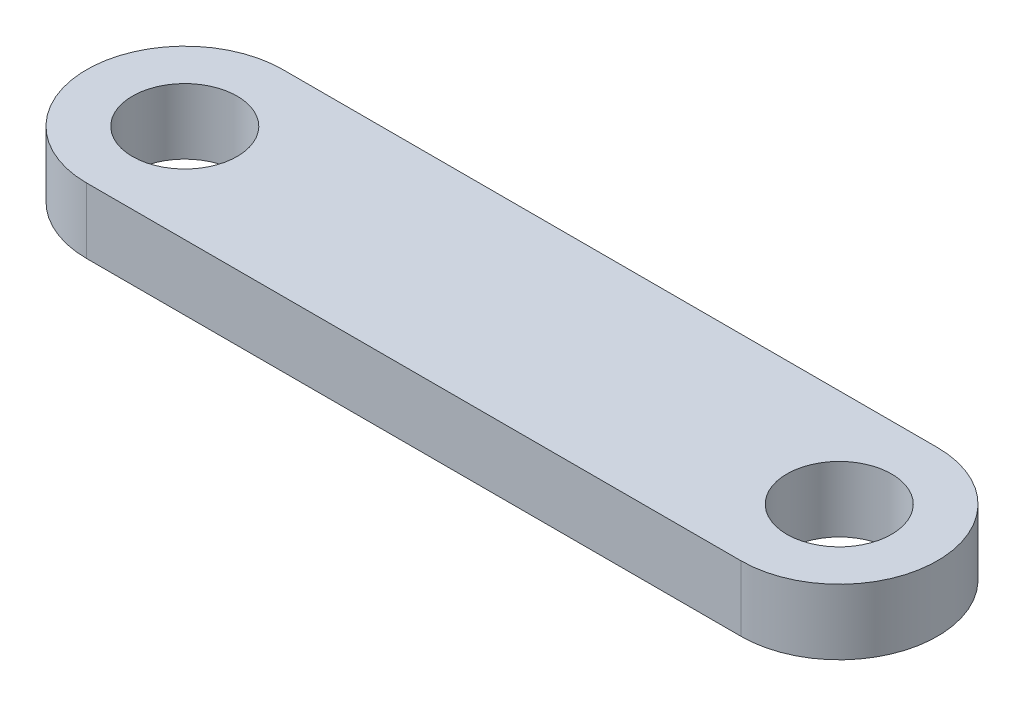
ISO-10303-21;
HEADER;
FILE_DESCRIPTION(('STEP AP214'),'2;1');
FILE_NAME('part.step','',(''),(''),'','','');
FILE_SCHEMA(('AUTOMOTIVE_DESIGN { 1 0 10303 214 1 1 1 1 }'));
ENDSEC;
DATA;
#1=APPLICATION_CONTEXT('core data for automotive mechanical design processes');
#2=APPLICATION_PROTOCOL_DEFINITION('international standard','automotive_design',2000,#1);
#3=PRODUCT_CONTEXT('',#1,'mechanical');
#4=PRODUCT('Part','Part','',(#3));
#5=PRODUCT_RELATED_PRODUCT_CATEGORY('part','',(#4));
#6=PRODUCT_DEFINITION_FORMATION('','',#4);
#7=PRODUCT_DEFINITION_CONTEXT('part definition',#1,'design');
#8=PRODUCT_DEFINITION('design','',#6,#7);
#9=PRODUCT_DEFINITION_SHAPE('','',#8);
#10=(LENGTH_UNIT() NAMED_UNIT(*) SI_UNIT(.MILLI.,.METRE.));
#11=(NAMED_UNIT(*) PLANE_ANGLE_UNIT() SI_UNIT($,.RADIAN.));
#12=(NAMED_UNIT(*) SI_UNIT($,.STERADIAN.) SOLID_ANGLE_UNIT());
#13=UNCERTAINTY_MEASURE_WITH_UNIT(LENGTH_MEASURE(1.E-05),#10,'distance_accuracy_value','');
#14=(GEOMETRIC_REPRESENTATION_CONTEXT(3) GLOBAL_UNCERTAINTY_ASSIGNED_CONTEXT((#13)) GLOBAL_UNIT_ASSIGNED_CONTEXT((#10,
#11,#12)) REPRESENTATION_CONTEXT('',''));
#15=CARTESIAN_POINT('',(0.,0.,0.));
#16=DIRECTION('',(0.,0.,1.));
#17=DIRECTION('',(1.,0.,0.));
#18=AXIS2_PLACEMENT_3D('',#15,#16,#17);
#19=CARTESIAN_POINT('',(0.,5.,0.));
#20=DIRECTION('',(0.,1.,0.));
#21=DIRECTION('',(0.,0.,1.));
#22=AXIS2_PLACEMENT_3D('',#19,#20,#21);
#23=PLANE('',#22);
#24=CARTESIAN_POINT('',(0.,5.,0.));
#25=DIRECTION('',(0.,1.,0.));
#26=DIRECTION('',(0.,0.,1.));
#27=AXIS2_PLACEMENT_3D('',#24,#25,#26);
#28=CIRCLE('',#27,4.);
#29=CARTESIAN_POINT('',(0.,5.,4.));
#30=VERTEX_POINT('',#29);
#31=EDGE_CURVE('E99',#30,#30,#28,.T.);
#32=ORIENTED_EDGE('',*,*,#31,.F.);
#33=EDGE_LOOP('',(#32));
#34=FACE_BOUND('',#33,.T.);
#35=CARTESIAN_POINT('',(0.,5.,0.));
#36=DIRECTION('',(0.,1.,0.));
#37=DIRECTION('',(0.,0.,1.));
#38=AXIS2_PLACEMENT_3D('',#35,#36,#37);
#39=CIRCLE('',#38,7.5);
#40=CARTESIAN_POINT('',(0.,5.,-7.5));
#41=VERTEX_POINT('',#40);
#42=CARTESIAN_POINT('',(0.,5.,7.5));
#43=VERTEX_POINT('',#42);
#44=EDGE_CURVE('E84',#41,#43,#39,.T.);
#45=ORIENTED_EDGE('',*,*,#44,.T.);
#46=DIRECTION('',(1.,0.,0.));
#47=VECTOR('',#46,1.);
#48=CARTESIAN_POINT('',(50.,5.,7.5));
#49=LINE('',#48,#47);
#50=CARTESIAN_POINT('',(50.,5.,7.5));
#51=VERTEX_POINT('',#50);
#52=EDGE_CURVE('E79',#43,#51,#49,.T.);
#53=ORIENTED_EDGE('',*,*,#52,.T.);
#54=CARTESIAN_POINT('',(50.,5.,0.));
#55=DIRECTION('',(0.,1.,0.));
#56=DIRECTION('',(0.,0.,1.));
#57=AXIS2_PLACEMENT_3D('',#54,#55,#56);
#58=CIRCLE('',#57,7.5);
#59=CARTESIAN_POINT('',(50.,5.,-7.5));
#60=VERTEX_POINT('',#59);
#61=EDGE_CURVE('E82',#51,#60,#58,.T.);
#62=ORIENTED_EDGE('',*,*,#61,.T.);
#63=DIRECTION('',(-1.,0.,0.));
#64=VECTOR('',#63,1.);
#65=CARTESIAN_POINT('',(0.,5.,-7.5));
#66=LINE('',#65,#64);
#67=EDGE_CURVE('E49',#60,#41,#66,.T.);
#68=ORIENTED_EDGE('',*,*,#67,.T.);
#69=EDGE_LOOP('',(#45,#53,#62,#68));
#70=FACE_BOUND('',#69,.T.);
#71=CARTESIAN_POINT('',(50.,5.,0.));
#72=DIRECTION('',(0.,1.,0.));
#73=DIRECTION('',(0.,0.,1.));
#74=AXIS2_PLACEMENT_3D('',#71,#72,#73);
#75=CIRCLE('',#74,4.00000000000001);
#76=CARTESIAN_POINT('',(50.,5.,4.00000000000001));
#77=VERTEX_POINT('',#76);
#78=EDGE_CURVE('E114',#77,#77,#75,.T.);
#79=ORIENTED_EDGE('',*,*,#78,.F.);
#80=EDGE_LOOP('',(#79));
#81=FACE_BOUND('',#80,.T.);
#82=ADVANCED_FACE('F32',(#34,#70,#81),#23,.T.);
#83=CARTESIAN_POINT('',(0.,0.,0.));
#84=DIRECTION('',(0.,1.,0.));
#85=DIRECTION('',(0.,0.,1.));
#86=AXIS2_PLACEMENT_3D('',#83,#84,#85);
#87=PLANE('',#86);
#88=CARTESIAN_POINT('',(0.,0.,0.));
#89=DIRECTION('',(0.,1.,0.));
#90=DIRECTION('',(0.,0.,1.));
#91=AXIS2_PLACEMENT_3D('',#88,#89,#90);
#92=CIRCLE('',#91,7.5);
#93=CARTESIAN_POINT('',(0.,0.,-7.5));
#94=VERTEX_POINT('',#93);
#95=CARTESIAN_POINT('',(0.,0.,7.5));
#96=VERTEX_POINT('',#95);
#97=EDGE_CURVE('E96',#94,#96,#92,.T.);
#98=ORIENTED_EDGE('',*,*,#97,.F.);
#99=DIRECTION('',(-1.,0.,0.));
#100=VECTOR('',#99,1.);
#101=CARTESIAN_POINT('',(0.,0.,-7.5));
#102=LINE('',#101,#100);
#103=CARTESIAN_POINT('',(50.,0.,-7.5));
#104=VERTEX_POINT('',#103);
#105=EDGE_CURVE('E72',#104,#94,#102,.T.);
#106=ORIENTED_EDGE('',*,*,#105,.F.);
#107=CARTESIAN_POINT('',(50.,0.,0.));
#108=DIRECTION('',(0.,1.,0.));
#109=DIRECTION('',(0.,0.,1.));
#110=AXIS2_PLACEMENT_3D('',#107,#108,#109);
#111=CIRCLE('',#110,7.5);
#112=CARTESIAN_POINT('',(50.,0.,7.5));
#113=VERTEX_POINT('',#112);
#114=EDGE_CURVE('E66',#113,#104,#111,.T.);
#115=ORIENTED_EDGE('',*,*,#114,.F.);
#116=DIRECTION('',(1.,0.,0.));
#117=VECTOR('',#116,1.);
#118=CARTESIAN_POINT('',(50.,0.,7.5));
#119=LINE('',#118,#117);
#120=EDGE_CURVE('E88',#96,#113,#119,.T.);
#121=ORIENTED_EDGE('',*,*,#120,.F.);
#122=EDGE_LOOP('',(#98,#106,#115,#121));
#123=FACE_BOUND('',#122,.T.);
#124=CARTESIAN_POINT('',(0.,0.,0.));
#125=DIRECTION('',(0.,1.,0.));
#126=DIRECTION('',(0.,0.,1.));
#127=AXIS2_PLACEMENT_3D('',#124,#125,#126);
#128=CIRCLE('',#127,4.);
#129=CARTESIAN_POINT('',(0.,0.,4.));
#130=VERTEX_POINT('',#129);
#131=EDGE_CURVE('E111',#130,#130,#128,.T.);
#132=ORIENTED_EDGE('',*,*,#131,.T.);
#133=EDGE_LOOP('',(#132));
#134=FACE_BOUND('',#133,.T.);
#135=CARTESIAN_POINT('',(50.,0.,0.));
#136=DIRECTION('',(0.,1.,0.));
#137=DIRECTION('',(0.,0.,1.));
#138=AXIS2_PLACEMENT_3D('',#135,#136,#137);
#139=CIRCLE('',#138,4.00000000000001);
#140=CARTESIAN_POINT('',(50.,0.,4.00000000000001));
#141=VERTEX_POINT('',#140);
#142=EDGE_CURVE('E117',#141,#141,#139,.T.);
#143=ORIENTED_EDGE('',*,*,#142,.T.);
#144=EDGE_LOOP('',(#143));
#145=FACE_BOUND('',#144,.T.);
#146=ADVANCED_FACE('F107',(#123,#134,#145),#87,.F.);
#147=CARTESIAN_POINT('',(0.,5.,0.));
#148=DIRECTION('',(0.,-1.,0.));
#149=DIRECTION('',(0.,0.,-1.));
#150=AXIS2_PLACEMENT_3D('',#147,#148,#149);
#151=CYLINDRICAL_SURFACE('',#150,7.5);
#152=ORIENTED_EDGE('',*,*,#97,.T.);
#153=DIRECTION('',(0.,-1.,0.));
#154=VECTOR('',#153,1.);
#155=CARTESIAN_POINT('',(0.,5.,7.5));
#156=LINE('',#155,#154);
#157=EDGE_CURVE('E11',#43,#96,#156,.T.);
#158=ORIENTED_EDGE('',*,*,#157,.F.);
#159=ORIENTED_EDGE('',*,*,#44,.F.);
#160=DIRECTION('',(0.,-1.,0.));
#161=VECTOR('',#160,1.);
#162=CARTESIAN_POINT('',(0.,5.,-7.5));
#163=LINE('',#162,#161);
#164=EDGE_CURVE('E92',#41,#94,#163,.T.);
#165=ORIENTED_EDGE('',*,*,#164,.T.);
#166=EDGE_LOOP('',(#152,#158,#159,#165));
#167=FACE_BOUND('',#166,.T.);
#168=ADVANCED_FACE('F34',(#167),#151,.T.);
#169=CARTESIAN_POINT('',(50.,5.,7.5));
#170=DIRECTION('',(0.,0.,-1.));
#171=DIRECTION('',(-1.,0.,0.));
#172=AXIS2_PLACEMENT_3D('',#169,#170,#171);
#173=PLANE('',#172);
#174=ORIENTED_EDGE('',*,*,#120,.T.);
#175=DIRECTION('',(0.,-1.,0.));
#176=VECTOR('',#175,1.);
#177=CARTESIAN_POINT('',(50.,5.,7.5));
#178=LINE('',#177,#176);
#179=EDGE_CURVE('E41',#51,#113,#178,.T.);
#180=ORIENTED_EDGE('',*,*,#179,.F.);
#181=ORIENTED_EDGE('',*,*,#52,.F.);
#182=ORIENTED_EDGE('',*,*,#157,.T.);
#183=EDGE_LOOP('',(#174,#180,#181,#182));
#184=FACE_BOUND('',#183,.T.);
#185=ADVANCED_FACE('F87',(#184),#173,.F.);
#186=CARTESIAN_POINT('',(50.,5.,0.));
#187=DIRECTION('',(0.,-1.,0.));
#188=DIRECTION('',(0.,0.,-1.));
#189=AXIS2_PLACEMENT_3D('',#186,#187,#188);
#190=CYLINDRICAL_SURFACE('',#189,7.5);
#191=ORIENTED_EDGE('',*,*,#114,.T.);
#192=DIRECTION('',(0.,-1.,0.));
#193=VECTOR('',#192,1.);
#194=CARTESIAN_POINT('',(50.,5.,-7.5));
#195=LINE('',#194,#193);
#196=EDGE_CURVE('E89',#60,#104,#195,.T.);
#197=ORIENTED_EDGE('',*,*,#196,.F.);
#198=ORIENTED_EDGE('',*,*,#61,.F.);
#199=ORIENTED_EDGE('',*,*,#179,.T.);
#200=EDGE_LOOP('',(#191,#197,#198,#199));
#201=FACE_BOUND('',#200,.T.);
#202=ADVANCED_FACE('F90',(#201),#190,.T.);
#203=CARTESIAN_POINT('',(0.,5.,-7.5));
#204=DIRECTION('',(0.,0.,1.));
#205=DIRECTION('',(1.,0.,0.));
#206=AXIS2_PLACEMENT_3D('',#203,#204,#205);
#207=PLANE('',#206);
#208=ORIENTED_EDGE('',*,*,#105,.T.);
#209=ORIENTED_EDGE('',*,*,#164,.F.);
#210=ORIENTED_EDGE('',*,*,#67,.F.);
#211=ORIENTED_EDGE('',*,*,#196,.T.);
#212=EDGE_LOOP('',(#208,#209,#210,#211));
#213=FACE_BOUND('',#212,.T.);
#214=ADVANCED_FACE('F104',(#213),#207,.F.);
#215=CARTESIAN_POINT('',(0.,5.,0.));
#216=DIRECTION('',(0.,-1.,0.));
#217=DIRECTION('',(0.,0.,-1.));
#218=AXIS2_PLACEMENT_3D('',#215,#216,#217);
#219=CYLINDRICAL_SURFACE('',#218,4.);
#220=ORIENTED_EDGE('',*,*,#31,.T.);
#221=EDGE_LOOP('',(#220));
#222=FACE_BOUND('',#221,.T.);
#223=ORIENTED_EDGE('',*,*,#131,.F.);
#224=EDGE_LOOP('',(#223));
#225=FACE_BOUND('',#224,.T.);
#226=ADVANCED_FACE('F134',(#222,#225),#219,.F.);
#227=CARTESIAN_POINT('',(50.,5.,0.));
#228=DIRECTION('',(0.,-1.,0.));
#229=DIRECTION('',(0.,0.,-1.));
#230=AXIS2_PLACEMENT_3D('',#227,#228,#229);
#231=CYLINDRICAL_SURFACE('',#230,4.00000000000001);
#232=ORIENTED_EDGE('',*,*,#78,.T.);
#233=EDGE_LOOP('',(#232));
#234=FACE_BOUND('',#233,.T.);
#235=ORIENTED_EDGE('',*,*,#142,.F.);
#236=EDGE_LOOP('',(#235));
#237=FACE_BOUND('',#236,.T.);
#238=ADVANCED_FACE('F123',(#234,#237),#231,.F.);
#239=CLOSED_SHELL('',(#82,#146,#168,#185,#202,#214,#226,#238));
#240=MANIFOLD_SOLID_BREP('B2',#239);
#241=ADVANCED_BREP_SHAPE_REPRESENTATION('',(#18,#240),#14);
#242=SHAPE_DEFINITION_REPRESENTATION(#9,#241);
ENDSEC;
END-ISO-10303-21;
